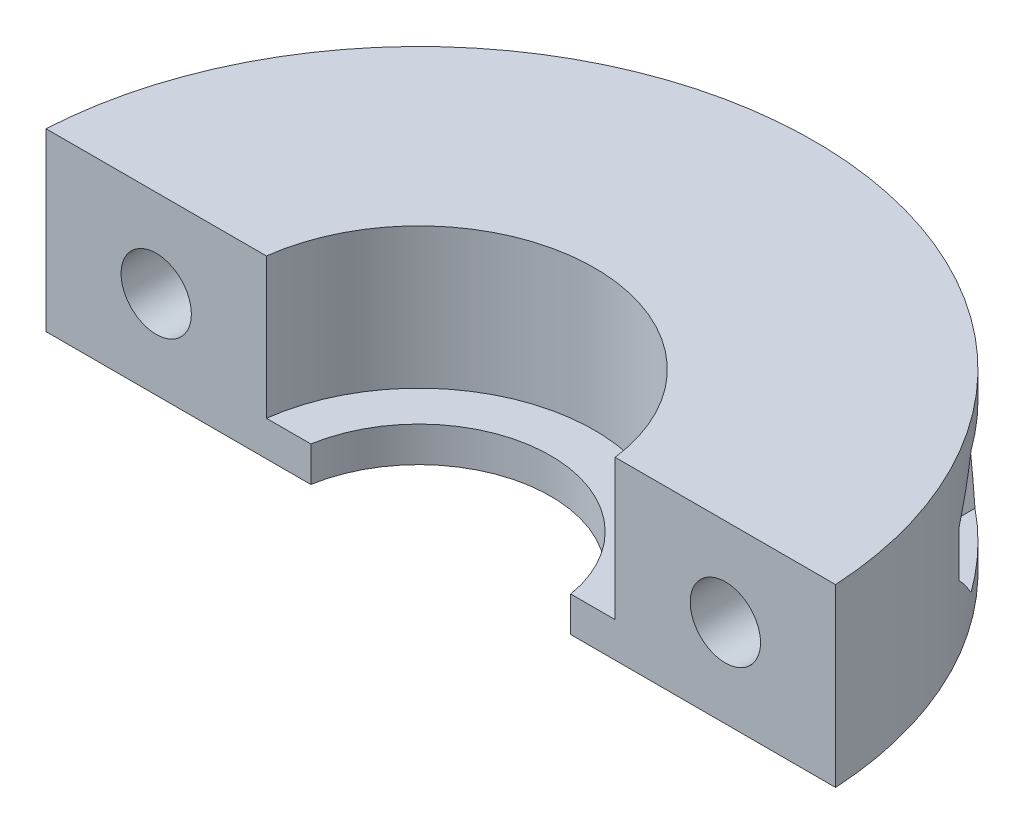
ISO-10303-21;
HEADER;
FILE_DESCRIPTION(('STEP AP214'),'2;1');
FILE_NAME('part.step','',(''),(''),'','','');
FILE_SCHEMA(('AUTOMOTIVE_DESIGN { 1 0 10303 214 1 1 1 1 }'));
ENDSEC;
DATA;
#1=APPLICATION_CONTEXT('core data for automotive mechanical design processes');
#2=APPLICATION_PROTOCOL_DEFINITION('international standard','automotive_design',2000,#1);
#3=PRODUCT_CONTEXT('',#1,'mechanical');
#4=PRODUCT('Part','Part','',(#3));
#5=PRODUCT_RELATED_PRODUCT_CATEGORY('part','',(#4));
#6=PRODUCT_DEFINITION_FORMATION('','',#4);
#7=PRODUCT_DEFINITION_CONTEXT('part definition',#1,'design');
#8=PRODUCT_DEFINITION('design','',#6,#7);
#9=PRODUCT_DEFINITION_SHAPE('','',#8);
#10=(LENGTH_UNIT() NAMED_UNIT(*) SI_UNIT(.MILLI.,.METRE.));
#11=(NAMED_UNIT(*) PLANE_ANGLE_UNIT() SI_UNIT($,.RADIAN.));
#12=(NAMED_UNIT(*) SI_UNIT($,.STERADIAN.) SOLID_ANGLE_UNIT());
#13=UNCERTAINTY_MEASURE_WITH_UNIT(LENGTH_MEASURE(1.E-05),#10,'distance_accuracy_value','');
#14=(GEOMETRIC_REPRESENTATION_CONTEXT(3) GLOBAL_UNCERTAINTY_ASSIGNED_CONTEXT((#13)) GLOBAL_UNIT_ASSIGNED_CONTEXT((#10,
#11,#12)) REPRESENTATION_CONTEXT('',''));
#15=CARTESIAN_POINT('',(0.,0.,0.));
#16=DIRECTION('',(0.,0.,1.));
#17=DIRECTION('',(1.,0.,0.));
#18=AXIS2_PLACEMENT_3D('',#15,#16,#17);
#19=CARTESIAN_POINT('',(0.,8.,0.));
#20=DIRECTION('',(0.,1.,0.));
#21=DIRECTION('',(0.,0.,1.));
#22=AXIS2_PLACEMENT_3D('',#19,#20,#21);
#23=PLANE('',#22);
#24=DIRECTION('',(-1.,0.,0.));
#25=VECTOR('',#24,1.);
#26=CARTESIAN_POINT('',(-20.,8.,-1.));
#27=LINE('',#26,#25);
#28=CARTESIAN_POINT('',(17.9722007556114,8.,-1.));
#29=VERTEX_POINT('',#28);
#30=CARTESIAN_POINT('',(7.93725393319377,8.,-1.));
#31=VERTEX_POINT('',#30);
#32=EDGE_CURVE('E268',#29,#31,#27,.T.);
#33=ORIENTED_EDGE('',*,*,#32,.F.);
#34=CARTESIAN_POINT('',(0.,8.,0.));
#35=DIRECTION('',(0.,1.,0.));
#36=DIRECTION('',(0.,0.,1.));
#37=AXIS2_PLACEMENT_3D('',#34,#35,#36);
#38=CIRCLE('',#37,18.);
#39=CARTESIAN_POINT('',(-17.9722007556114,8.,-1.));
#40=VERTEX_POINT('',#39);
#41=EDGE_CURVE('E293',#29,#40,#38,.T.);
#42=ORIENTED_EDGE('',*,*,#41,.T.);
#43=CARTESIAN_POINT('',(-7.93725393319377,8.,-1.));
#44=VERTEX_POINT('',#43);
#45=EDGE_CURVE('E263',#44,#40,#27,.T.);
#46=ORIENTED_EDGE('',*,*,#45,.F.);
#47=CARTESIAN_POINT('',(0.,8.,0.));
#48=DIRECTION('',(0.,1.,0.));
#49=DIRECTION('',(0.,0.,1.));
#50=AXIS2_PLACEMENT_3D('',#47,#48,#49);
#51=CIRCLE('',#50,8.);
#52=EDGE_CURVE('E287',#31,#44,#51,.T.);
#53=ORIENTED_EDGE('',*,*,#52,.F.);
#54=EDGE_LOOP('',(#33,#42,#46,#53));
#55=FACE_BOUND('',#54,.T.);
#56=ADVANCED_FACE('F32',(#55),#23,.T.);
#57=CARTESIAN_POINT('',(0.,0.,0.));
#58=DIRECTION('',(0.,1.,0.));
#59=DIRECTION('',(0.,0.,1.));
#60=AXIS2_PLACEMENT_3D('',#57,#58,#59);
#61=PLANE('',#60);
#62=CARTESIAN_POINT('',(0.,0.,0.));
#63=DIRECTION('',(0.,1.,0.));
#64=DIRECTION('',(0.,0.,1.));
#65=AXIS2_PLACEMENT_3D('',#62,#63,#64);
#66=CIRCLE('',#65,18.);
#67=CARTESIAN_POINT('',(17.9722007556114,0.,-1.));
#68=VERTEX_POINT('',#67);
#69=CARTESIAN_POINT('',(-17.9722007556114,0.,-1.));
#70=VERTEX_POINT('',#69);
#71=EDGE_CURVE('E292',#68,#70,#66,.T.);
#72=ORIENTED_EDGE('',*,*,#71,.F.);
#73=DIRECTION('',(-1.,0.,0.));
#74=VECTOR('',#73,1.);
#75=CARTESIAN_POINT('',(-20.,0.,-1.));
#76=LINE('',#75,#74);
#77=CARTESIAN_POINT('',(5.91607978309962,0.,-1.));
#78=VERTEX_POINT('',#77);
#79=EDGE_CURVE('E267',#68,#78,#76,.T.);
#80=ORIENTED_EDGE('',*,*,#79,.T.);
#81=CARTESIAN_POINT('',(0.,0.,0.));
#82=DIRECTION('',(0.,1.,0.));
#83=DIRECTION('',(0.,0.,1.));
#84=AXIS2_PLACEMENT_3D('',#81,#82,#83);
#85=CIRCLE('',#84,6.);
#86=CARTESIAN_POINT('',(-5.91607978309962,0.,-1.));
#87=VERTEX_POINT('',#86);
#88=EDGE_CURVE('E283',#78,#87,#85,.T.);
#89=ORIENTED_EDGE('',*,*,#88,.T.);
#90=EDGE_CURVE('E264',#87,#70,#76,.T.);
#91=ORIENTED_EDGE('',*,*,#90,.T.);
#92=EDGE_LOOP('',(#72,#80,#89,#91));
#93=FACE_BOUND('',#92,.T.);
#94=ADVANCED_FACE('F319',(#93),#61,.F.);
#95=CARTESIAN_POINT('',(0.,8.,0.));
#96=DIRECTION('',(0.,-1.,0.));
#97=DIRECTION('',(0.,0.,-1.));
#98=AXIS2_PLACEMENT_3D('',#95,#96,#97);
#99=CYLINDRICAL_SURFACE('',#98,18.);
#100=CARTESIAN_POINT('',(0.,1.19999999999999,0.));
#101=DIRECTION('',(0.,-1.,0.));
#102=DIRECTION('',(1.,0.,0.));
#103=AXIS2_PLACEMENT_3D('',#100,#101,#102);
#104=CIRCLE('',#103,18.);
#105=CARTESIAN_POINT('',(14.5713080981335,1.2,-10.5677329787078));
#106=VERTEX_POINT('',#105);
#107=CARTESIAN_POINT('',(11.3381465906717,1.2,-13.9802157311123));
#108=VERTEX_POINT('',#107);
#109=EDGE_CURVE('E181',#106,#108,#104,.F.);
#110=ORIENTED_EDGE('',*,*,#109,.F.);
#111=CARTESIAN_POINT('',(0.,-24.0382459587072,0.));
#112=DIRECTION('',(0.866025403784439,-0.5,0.));
#113=DIRECTION('',(-0.5,-0.866025403784439,0.));
#114=AXIS2_PLACEMENT_3D('',#111,#112,#113);
#115=ELLIPSE('',#114,36.,18.);
#116=CARTESIAN_POINT('',(15.5884572681199,2.96175404129287,-9.));
#117=VERTEX_POINT('',#116);
#118=EDGE_CURVE('E162',#117,#106,#115,.F.);
#119=ORIENTED_EDGE('',*,*,#118,.F.);
#120=DIRECTION('',(0.,-1.,0.));
#121=VECTOR('',#120,1.);
#122=CARTESIAN_POINT('',(15.5884572681199,8.,-9.));
#123=LINE('',#122,#121);
#124=CARTESIAN_POINT('',(15.5884572681199,5.03824595870713,-9.));
#125=VERTEX_POINT('',#124);
#126=EDGE_CURVE('E171',#125,#117,#123,.T.);
#127=ORIENTED_EDGE('',*,*,#126,.F.);
#128=CARTESIAN_POINT('',(0.,32.0382459587071,0.));
#129=DIRECTION('',(0.866025403784438,0.5,0.));
#130=DIRECTION('',(0.5,-0.866025403784439,0.));
#131=AXIS2_PLACEMENT_3D('',#128,#129,#130);
#132=ELLIPSE('',#131,36.,18.);
#133=CARTESIAN_POINT('',(14.5713080981335,6.8,-10.5677329787078));
#134=VERTEX_POINT('',#133);
#135=EDGE_CURVE('E47',#134,#125,#132,.F.);
#136=ORIENTED_EDGE('',*,*,#135,.F.);
#137=CARTESIAN_POINT('',(0.,6.79999999999999,0.));
#138=DIRECTION('',(0.,1.,0.));
#139=DIRECTION('',(-1.,0.,0.));
#140=AXIS2_PLACEMENT_3D('',#137,#138,#139);
#141=CIRCLE('',#140,18.);
#142=CARTESIAN_POINT('',(11.3381465906717,6.8,-13.9802157311123));
#143=VERTEX_POINT('',#142);
#144=EDGE_CURVE('E557',#143,#134,#141,.F.);
#145=ORIENTED_EDGE('',*,*,#144,.F.);
#146=CARTESIAN_POINT('',(0.,-12.8382459587072,0.));
#147=DIRECTION('',(-0.866025403784439,0.5,0.));
#148=DIRECTION('',(-0.5,-0.866025403784439,0.));
#149=AXIS2_PLACEMENT_3D('',#146,#147,#148);
#150=ELLIPSE('',#149,36.,18.);
#151=CARTESIAN_POINT('',(9.7215658369407,4.,-15.1489655646195));
#152=VERTEX_POINT('',#151);
#153=EDGE_CURVE('E560',#152,#143,#150,.F.);
#154=ORIENTED_EDGE('',*,*,#153,.F.);
#155=CARTESIAN_POINT('',(0.,20.8382459587071,0.));
#156=DIRECTION('',(-0.866025403784438,-0.5,0.));
#157=DIRECTION('',(0.5,-0.866025403784439,0.));
#158=AXIS2_PLACEMENT_3D('',#155,#156,#157);
#159=ELLIPSE('',#158,36.,18.);
#160=EDGE_CURVE('E183',#108,#152,#159,.F.);
#161=ORIENTED_EDGE('',*,*,#160,.F.);
#162=EDGE_LOOP('',(#110,#119,#127,#136,#145,#154,#161));
#163=FACE_BOUND('',#162,.T.);
#164=CARTESIAN_POINT('',(0.,-12.8382459587071,0.));
#165=DIRECTION('',(0.866025403784438,0.5,0.));
#166=DIRECTION('',(0.5,-0.866025403784439,0.));
#167=AXIS2_PLACEMENT_3D('',#164,#165,#166);
#168=ELLIPSE('',#167,36.,18.);
#169=CARTESIAN_POINT('',(-11.3381465906716,6.8,-13.9802157311124));
#170=VERTEX_POINT('',#169);
#171=CARTESIAN_POINT('',(-9.72156583694069,4.,-15.1489655646195));
#172=VERTEX_POINT('',#171);
#173=EDGE_CURVE('E219',#170,#172,#168,.F.);
#174=ORIENTED_EDGE('',*,*,#173,.F.);
#175=CARTESIAN_POINT('',(0.,6.8,0.));
#176=DIRECTION('',(0.,1.,0.));
#177=DIRECTION('',(-1.,0.,0.));
#178=AXIS2_PLACEMENT_3D('',#175,#176,#177);
#179=CIRCLE('',#178,18.);
#180=CARTESIAN_POINT('',(-14.5713080981335,6.8,-10.5677329787078));
#181=VERTEX_POINT('',#180);
#182=EDGE_CURVE('E222',#181,#170,#179,.F.);
#183=ORIENTED_EDGE('',*,*,#182,.F.);
#184=CARTESIAN_POINT('',(0.,32.0382459587072,0.));
#185=DIRECTION('',(-0.866025403784439,0.499999999999999,0.));
#186=DIRECTION('',(-0.499999999999999,-0.866025403784439,0.));
#187=AXIS2_PLACEMENT_3D('',#184,#185,#186);
#188=ELLIPSE('',#187,36.0000000000001,18.);
#189=CARTESIAN_POINT('',(-15.5884572681199,5.03824595870713,-9.));
#190=VERTEX_POINT('',#189);
#191=EDGE_CURVE('E175',#190,#181,#188,.F.);
#192=ORIENTED_EDGE('',*,*,#191,.F.);
#193=DIRECTION('',(0.,-1.,0.));
#194=VECTOR('',#193,1.);
#195=CARTESIAN_POINT('',(-15.5884572681199,8.,-9.));
#196=LINE('',#195,#194);
#197=CARTESIAN_POINT('',(-15.5884572681199,2.96175404129287,-9.));
#198=VERTEX_POINT('',#197);
#199=EDGE_CURVE('E254',#198,#190,#196,.F.);
#200=ORIENTED_EDGE('',*,*,#199,.F.);
#201=CARTESIAN_POINT('',(0.,-24.0382459587071,0.));
#202=DIRECTION('',(-0.866025403784438,-0.5,0.));
#203=DIRECTION('',(0.5,-0.866025403784439,0.));
#204=AXIS2_PLACEMENT_3D('',#201,#202,#203);
#205=ELLIPSE('',#204,36.,18.);
#206=CARTESIAN_POINT('',(-14.5713080981336,1.2,-10.5677329787078));
#207=VERTEX_POINT('',#206);
#208=EDGE_CURVE('E55',#207,#198,#205,.F.);
#209=ORIENTED_EDGE('',*,*,#208,.F.);
#210=CARTESIAN_POINT('',(0.,1.20000000000001,0.));
#211=DIRECTION('',(0.,-1.,0.));
#212=DIRECTION('',(1.,0.,0.));
#213=AXIS2_PLACEMENT_3D('',#210,#211,#212);
#214=CIRCLE('',#213,18.);
#215=CARTESIAN_POINT('',(-11.3381465906716,1.2,-13.9802157311123));
#216=VERTEX_POINT('',#215);
#217=EDGE_CURVE('E213',#216,#207,#214,.F.);
#218=ORIENTED_EDGE('',*,*,#217,.F.);
#219=CARTESIAN_POINT('',(0.,20.8382459587072,0.));
#220=DIRECTION('',(0.866025403784439,-0.5,0.));
#221=DIRECTION('',(-0.5,-0.866025403784439,0.));
#222=AXIS2_PLACEMENT_3D('',#219,#220,#221);
#223=ELLIPSE('',#222,36.,18.);
#224=EDGE_CURVE('E216',#172,#216,#223,.F.);
#225=ORIENTED_EDGE('',*,*,#224,.F.);
#226=EDGE_LOOP('',(#174,#183,#192,#200,#209,#218,#225));
#227=FACE_BOUND('',#226,.T.);
#228=ORIENTED_EDGE('',*,*,#41,.F.);
#229=DIRECTION('',(0.,-1.,0.));
#230=VECTOR('',#229,1.);
#231=CARTESIAN_POINT('',(17.9722007556114,8.,-1.));
#232=LINE('',#231,#230);
#233=EDGE_CURVE('E280',#29,#68,#232,.T.);
#234=ORIENTED_EDGE('',*,*,#233,.T.);
#235=ORIENTED_EDGE('',*,*,#71,.T.);
#236=DIRECTION('',(0.,-1.,0.));
#237=VECTOR('',#236,1.);
#238=CARTESIAN_POINT('',(-17.9722007556114,8.,-1.));
#239=LINE('',#238,#237);
#240=EDGE_CURVE('E277',#70,#40,#239,.F.);
#241=ORIENTED_EDGE('',*,*,#240,.T.);
#242=EDGE_LOOP('',(#228,#234,#235,#241));
#243=FACE_BOUND('',#242,.T.);
#244=ADVANCED_FACE('F34',(#163,#227,#243),#99,.T.);
#245=CARTESIAN_POINT('',(0.,8.,0.));
#246=DIRECTION('',(0.,-1.,0.));
#247=DIRECTION('',(0.,0.,-1.));
#248=AXIS2_PLACEMENT_3D('',#245,#246,#247);
#249=CYLINDRICAL_SURFACE('',#248,8.);
#250=DIRECTION('',(0.,-1.,0.));
#251=VECTOR('',#250,1.);
#252=CARTESIAN_POINT('',(7.93725393319377,8.,-1.));
#253=LINE('',#252,#251);
#254=CARTESIAN_POINT('',(7.93725393319377,1.6,-1.));
#255=VERTEX_POINT('',#254);
#256=EDGE_CURVE('E275',#31,#255,#253,.T.);
#257=ORIENTED_EDGE('',*,*,#256,.F.);
#258=ORIENTED_EDGE('',*,*,#52,.T.);
#259=DIRECTION('',(0.,-1.,0.));
#260=VECTOR('',#259,1.);
#261=CARTESIAN_POINT('',(-7.93725393319377,8.,-1.));
#262=LINE('',#261,#260);
#263=CARTESIAN_POINT('',(-7.93725393319377,1.6,-1.));
#264=VERTEX_POINT('',#263);
#265=EDGE_CURVE('E272',#264,#44,#262,.F.);
#266=ORIENTED_EDGE('',*,*,#265,.F.);
#267=CARTESIAN_POINT('',(0.,1.6,0.));
#268=DIRECTION('',(0.,1.,0.));
#269=DIRECTION('',(0.,0.,1.));
#270=AXIS2_PLACEMENT_3D('',#267,#268,#269);
#271=CIRCLE('',#270,8.);
#272=EDGE_CURVE('E296',#255,#264,#271,.T.);
#273=ORIENTED_EDGE('',*,*,#272,.F.);
#274=EDGE_LOOP('',(#257,#258,#266,#273));
#275=FACE_BOUND('',#274,.T.);
#276=ADVANCED_FACE('F328',(#275),#249,.F.);
#277=CARTESIAN_POINT('',(0.,1.6,0.));
#278=DIRECTION('',(0.,1.,0.));
#279=DIRECTION('',(0.,0.,1.));
#280=AXIS2_PLACEMENT_3D('',#277,#278,#279);
#281=PLANE('',#280);
#282=DIRECTION('',(-1.,0.,0.));
#283=VECTOR('',#282,1.);
#284=CARTESIAN_POINT('',(0.,1.6,-1.));
#285=LINE('',#284,#283);
#286=CARTESIAN_POINT('',(5.91607978309962,1.6,-1.));
#287=VERTEX_POINT('',#286);
#288=EDGE_CURVE('E273',#255,#287,#285,.T.);
#289=ORIENTED_EDGE('',*,*,#288,.F.);
#290=ORIENTED_EDGE('',*,*,#272,.T.);
#291=CARTESIAN_POINT('',(-5.91607978309962,1.6,-1.));
#292=VERTEX_POINT('',#291);
#293=EDGE_CURVE('E270',#292,#264,#285,.T.);
#294=ORIENTED_EDGE('',*,*,#293,.F.);
#295=CARTESIAN_POINT('',(0.,1.6,0.));
#296=DIRECTION('',(0.,1.,0.));
#297=DIRECTION('',(0.,0.,1.));
#298=AXIS2_PLACEMENT_3D('',#295,#296,#297);
#299=CIRCLE('',#298,6.);
#300=EDGE_CURVE('E284',#287,#292,#299,.T.);
#301=ORIENTED_EDGE('',*,*,#300,.F.);
#302=EDGE_LOOP('',(#289,#290,#294,#301));
#303=FACE_BOUND('',#302,.T.);
#304=ADVANCED_FACE('F310',(#303),#281,.T.);
#305=CARTESIAN_POINT('',(0.,1.6,0.));
#306=DIRECTION('',(0.,-1.,0.));
#307=DIRECTION('',(0.,0.,-1.));
#308=AXIS2_PLACEMENT_3D('',#305,#306,#307);
#309=CYLINDRICAL_SURFACE('',#308,6.);
#310=DIRECTION('',(0.,-1.,0.));
#311=VECTOR('',#310,1.);
#312=CARTESIAN_POINT('',(5.91607978309962,1.6,-1.));
#313=LINE('',#312,#311);
#314=EDGE_CURVE('E11',#287,#78,#313,.T.);
#315=ORIENTED_EDGE('',*,*,#314,.F.);
#316=ORIENTED_EDGE('',*,*,#300,.T.);
#317=DIRECTION('',(0.,-1.,0.));
#318=VECTOR('',#317,1.);
#319=CARTESIAN_POINT('',(-5.91607978309962,1.6,-1.));
#320=LINE('',#319,#318);
#321=EDGE_CURVE('E40',#87,#292,#320,.F.);
#322=ORIENTED_EDGE('',*,*,#321,.F.);
#323=ORIENTED_EDGE('',*,*,#88,.F.);
#324=EDGE_LOOP('',(#315,#316,#322,#323));
#325=FACE_BOUND('',#324,.T.);
#326=ADVANCED_FACE('F313',(#325),#309,.F.);
#327=CARTESIAN_POINT('',(-20.,0.,-1.));
#328=DIRECTION('',(0.,0.,-1.));
#329=DIRECTION('',(-1.,0.,0.));
#330=AXIS2_PLACEMENT_3D('',#327,#328,#329);
#331=PLANE('',#330);
#332=CARTESIAN_POINT('',(-12.9547273444026,4.,-1.));
#333=DIRECTION('',(0.,0.,1.));
#334=DIRECTION('',(1.,0.,0.));
#335=AXIS2_PLACEMENT_3D('',#332,#333,#334);
#336=CIRCLE('',#335,1.6);
#337=CARTESIAN_POINT('',(-11.3547273444026,4.,-1.));
#338=VERTEX_POINT('',#337);
#339=EDGE_CURVE('E260',#338,#338,#336,.T.);
#340=ORIENTED_EDGE('',*,*,#339,.F.);
#341=EDGE_LOOP('',(#340));
#342=FACE_BOUND('',#341,.T.);
#343=ORIENTED_EDGE('',*,*,#90,.F.);
#344=ORIENTED_EDGE('',*,*,#321,.T.);
#345=ORIENTED_EDGE('',*,*,#293,.T.);
#346=ORIENTED_EDGE('',*,*,#265,.T.);
#347=ORIENTED_EDGE('',*,*,#45,.T.);
#348=ORIENTED_EDGE('',*,*,#240,.F.);
#349=EDGE_LOOP('',(#343,#344,#345,#346,#347,#348));
#350=FACE_BOUND('',#349,.T.);
#351=ADVANCED_FACE('F303',(#342,#350),#331,.F.);
#352=CARTESIAN_POINT('',(12.9547273444026,4.,-1.));
#353=DIRECTION('',(0.,0.,1.));
#354=DIRECTION('',(1.,0.,0.));
#355=AXIS2_PLACEMENT_3D('',#352,#353,#354);
#356=CIRCLE('',#355,1.6);
#357=CARTESIAN_POINT('',(14.5547273444026,4.,-1.));
#358=VERTEX_POINT('',#357);
#359=EDGE_CURVE('E257',#358,#358,#356,.T.);
#360=ORIENTED_EDGE('',*,*,#359,.F.);
#361=EDGE_LOOP('',(#360));
#362=FACE_BOUND('',#361,.T.);
#363=ORIENTED_EDGE('',*,*,#32,.T.);
#364=ORIENTED_EDGE('',*,*,#256,.T.);
#365=ORIENTED_EDGE('',*,*,#288,.T.);
#366=ORIENTED_EDGE('',*,*,#314,.T.);
#367=ORIENTED_EDGE('',*,*,#79,.F.);
#368=ORIENTED_EDGE('',*,*,#233,.F.);
#369=EDGE_LOOP('',(#363,#364,#365,#366,#367,#368));
#370=FACE_BOUND('',#369,.T.);
#371=ADVANCED_FACE('F316',(#362,#370),#331,.F.);
#372=CARTESIAN_POINT('',(-12.9547273444026,4.,-18.001));
#373=DIRECTION('',(0.,0.,1.));
#374=DIRECTION('',(1.,0.,0.));
#375=AXIS2_PLACEMENT_3D('',#372,#373,#374);
#376=CYLINDRICAL_SURFACE('',#375,1.6);
#377=CARTESIAN_POINT('',(-12.9547273444026,4.,-9.));
#378=DIRECTION('',(0.,0.,1.));
#379=DIRECTION('',(1.,0.,0.));
#380=AXIS2_PLACEMENT_3D('',#377,#378,#379);
#381=CIRCLE('',#380,1.6);
#382=CARTESIAN_POINT('',(-11.3547273444026,4.,-9.));
#383=VERTEX_POINT('',#382);
#384=EDGE_CURVE('E244',#383,#383,#381,.T.);
#385=ORIENTED_EDGE('',*,*,#384,.F.);
#386=EDGE_LOOP('',(#385));
#387=FACE_BOUND('',#386,.T.);
#388=ORIENTED_EDGE('',*,*,#339,.T.);
#389=EDGE_LOOP('',(#388));
#390=FACE_BOUND('',#389,.T.);
#391=ADVANCED_FACE('F359',(#387,#390),#376,.F.);
#392=CARTESIAN_POINT('',(12.9547273444026,4.,-18.001));
#393=DIRECTION('',(0.,0.,1.));
#394=DIRECTION('',(1.,0.,0.));
#395=AXIS2_PLACEMENT_3D('',#392,#393,#394);
#396=CYLINDRICAL_SURFACE('',#395,1.6);
#397=CARTESIAN_POINT('',(12.9547273444026,4.,-9.));
#398=DIRECTION('',(0.,0.,1.));
#399=DIRECTION('',(1.,0.,0.));
#400=AXIS2_PLACEMENT_3D('',#397,#398,#399);
#401=CIRCLE('',#400,1.6);
#402=CARTESIAN_POINT('',(14.5547273444026,4.,-9.));
#403=VERTEX_POINT('',#402);
#404=EDGE_CURVE('E176',#403,#403,#401,.T.);
#405=ORIENTED_EDGE('',*,*,#404,.F.);
#406=EDGE_LOOP('',(#405));
#407=FACE_BOUND('',#406,.T.);
#408=ORIENTED_EDGE('',*,*,#359,.T.);
#409=EDGE_LOOP('',(#408));
#410=FACE_BOUND('',#409,.T.);
#411=ADVANCED_FACE('F364',(#407,#410),#396,.F.);
#412=CARTESIAN_POINT('',(-11.3381465906716,1.2,-18.001));
#413=DIRECTION('',(0.866025403784439,-0.5,0.));
#414=DIRECTION('',(0.5,0.866025403784439,0.));
#415=AXIS2_PLACEMENT_3D('',#412,#413,#414);
#416=PLANE('',#415);
#417=ORIENTED_EDGE('',*,*,#224,.T.);
#418=DIRECTION('',(0.,0.,1.));
#419=VECTOR('',#418,1.);
#420=CARTESIAN_POINT('',(-11.3381465906716,1.2,-18.001));
#421=LINE('',#420,#419);
#422=CARTESIAN_POINT('',(-11.3381465906716,1.2,-9.));
#423=VERTEX_POINT('',#422);
#424=EDGE_CURVE('E242',#216,#423,#421,.T.);
#425=ORIENTED_EDGE('',*,*,#424,.T.);
#426=DIRECTION('',(0.5,0.866025403784439,0.));
#427=VECTOR('',#426,1.);
#428=CARTESIAN_POINT('',(-11.3381465906716,1.2,-9.));
#429=LINE('',#428,#427);
#430=CARTESIAN_POINT('',(-9.72156583694069,4.,-9.));
#431=VERTEX_POINT('',#430);
#432=EDGE_CURVE('E225',#423,#431,#429,.T.);
#433=ORIENTED_EDGE('',*,*,#432,.T.);
#434=DIRECTION('',(0.,0.,1.));
#435=VECTOR('',#434,1.);
#436=CARTESIAN_POINT('',(-9.72156583694069,4.,-18.001));
#437=LINE('',#436,#435);
#438=EDGE_CURVE('E241',#172,#431,#437,.T.);
#439=ORIENTED_EDGE('',*,*,#438,.F.);
#440=EDGE_LOOP('',(#417,#425,#433,#439));
#441=FACE_BOUND('',#440,.T.);
#442=ADVANCED_FACE('F374',(#441),#416,.F.);
#443=CARTESIAN_POINT('',(-14.5713080981336,1.2,-18.001));
#444=DIRECTION('',(0.,-1.,0.));
#445=DIRECTION('',(1.,0.,0.));
#446=AXIS2_PLACEMENT_3D('',#443,#444,#445);
#447=PLANE('',#446);
#448=ORIENTED_EDGE('',*,*,#217,.T.);
#449=DIRECTION('',(0.,0.,1.));
#450=VECTOR('',#449,1.);
#451=CARTESIAN_POINT('',(-14.5713080981336,1.2,-18.001));
#452=LINE('',#451,#450);
#453=CARTESIAN_POINT('',(-14.5713080981336,1.2,-9.));
#454=VERTEX_POINT('',#453);
#455=EDGE_CURVE('E245',#207,#454,#452,.T.);
#456=ORIENTED_EDGE('',*,*,#455,.T.);
#457=DIRECTION('',(1.,0.,0.));
#458=VECTOR('',#457,1.);
#459=CARTESIAN_POINT('',(-14.5713080981336,1.2,-9.));
#460=LINE('',#459,#458);
#461=EDGE_CURVE('E238',#454,#423,#460,.T.);
#462=ORIENTED_EDGE('',*,*,#461,.T.);
#463=ORIENTED_EDGE('',*,*,#424,.F.);
#464=EDGE_LOOP('',(#448,#456,#462,#463));
#465=FACE_BOUND('',#464,.T.);
#466=ADVANCED_FACE('F384',(#465),#447,.F.);
#467=CARTESIAN_POINT('',(-16.1878888518645,3.99999999999999,-18.001));
#468=DIRECTION('',(-0.866025403784438,-0.5,0.));
#469=DIRECTION('',(0.5,-0.866025403784439,0.));
#470=AXIS2_PLACEMENT_3D('',#467,#468,#469);
#471=PLANE('',#470);
#472=ORIENTED_EDGE('',*,*,#208,.T.);
#473=DIRECTION('',(0.5,-0.866025403784439,0.));
#474=VECTOR('',#473,1.);
#475=CARTESIAN_POINT('',(-16.1878888518645,3.99999999999999,-9.));
#476=LINE('',#475,#474);
#477=EDGE_CURVE('E236',#198,#454,#476,.T.);
#478=ORIENTED_EDGE('',*,*,#477,.T.);
#479=ORIENTED_EDGE('',*,*,#455,.F.);
#480=EDGE_LOOP('',(#472,#478,#479));
#481=FACE_BOUND('',#480,.T.);
#482=ADVANCED_FACE('F394',(#481),#471,.F.);
#483=CARTESIAN_POINT('',(-14.5713080981335,6.8,-18.001));
#484=DIRECTION('',(-0.866025403784439,0.499999999999999,0.));
#485=DIRECTION('',(-0.499999999999999,-0.866025403784439,0.));
#486=AXIS2_PLACEMENT_3D('',#483,#484,#485);
#487=PLANE('',#486);
#488=ORIENTED_EDGE('',*,*,#191,.T.);
#489=DIRECTION('',(0.,0.,1.));
#490=VECTOR('',#489,1.);
#491=CARTESIAN_POINT('',(-14.5713080981335,6.8,-18.001));
#492=LINE('',#491,#490);
#493=CARTESIAN_POINT('',(-14.5713080981335,6.8,-9.));
#494=VERTEX_POINT('',#493);
#495=EDGE_CURVE('E247',#181,#494,#492,.T.);
#496=ORIENTED_EDGE('',*,*,#495,.T.);
#497=DIRECTION('',(-0.499999999999999,-0.866025403784439,0.));
#498=VECTOR('',#497,1.);
#499=CARTESIAN_POINT('',(-14.5713080981335,6.8,-9.));
#500=LINE('',#499,#498);
#501=EDGE_CURVE('E234',#494,#190,#500,.T.);
#502=ORIENTED_EDGE('',*,*,#501,.T.);
#503=EDGE_LOOP('',(#488,#496,#502));
#504=FACE_BOUND('',#503,.T.);
#505=ADVANCED_FACE('F404',(#504),#487,.F.);
#506=CARTESIAN_POINT('',(-11.3381465906716,6.8,-18.001));
#507=DIRECTION('',(0.,1.,0.));
#508=DIRECTION('',(-1.,0.,0.));
#509=AXIS2_PLACEMENT_3D('',#506,#507,#508);
#510=PLANE('',#509);
#511=ORIENTED_EDGE('',*,*,#182,.T.);
#512=DIRECTION('',(0.,0.,1.));
#513=VECTOR('',#512,1.);
#514=CARTESIAN_POINT('',(-11.3381465906716,6.8,-18.001));
#515=LINE('',#514,#513);
#516=CARTESIAN_POINT('',(-11.3381465906716,6.8,-9.));
#517=VERTEX_POINT('',#516);
#518=EDGE_CURVE('E249',#170,#517,#515,.T.);
#519=ORIENTED_EDGE('',*,*,#518,.T.);
#520=DIRECTION('',(-1.,0.,0.));
#521=VECTOR('',#520,1.);
#522=CARTESIAN_POINT('',(-11.3381465906716,6.8,-9.));
#523=LINE('',#522,#521);
#524=EDGE_CURVE('E231',#517,#494,#523,.T.);
#525=ORIENTED_EDGE('',*,*,#524,.T.);
#526=ORIENTED_EDGE('',*,*,#495,.F.);
#527=EDGE_LOOP('',(#511,#519,#525,#526));
#528=FACE_BOUND('',#527,.T.);
#529=ADVANCED_FACE('F413',(#528),#510,.F.);
#530=CARTESIAN_POINT('',(-9.72156583694069,4.,-18.001));
#531=DIRECTION('',(0.866025403784438,0.5,0.));
#532=DIRECTION('',(-0.5,0.866025403784439,0.));
#533=AXIS2_PLACEMENT_3D('',#530,#531,#532);
#534=PLANE('',#533);
#535=ORIENTED_EDGE('',*,*,#173,.T.);
#536=ORIENTED_EDGE('',*,*,#438,.T.);
#537=DIRECTION('',(-0.5,0.866025403784438,0.));
#538=VECTOR('',#537,1.);
#539=CARTESIAN_POINT('',(-9.72156583694069,4.,-9.));
#540=LINE('',#539,#538);
#541=EDGE_CURVE('E228',#431,#517,#540,.T.);
#542=ORIENTED_EDGE('',*,*,#541,.T.);
#543=ORIENTED_EDGE('',*,*,#518,.F.);
#544=EDGE_LOOP('',(#535,#536,#542,#543));
#545=FACE_BOUND('',#544,.T.);
#546=ADVANCED_FACE('F423',(#545),#534,.F.);
#547=CARTESIAN_POINT('',(0.,0.,-9.));
#548=DIRECTION('',(0.,0.,1.));
#549=DIRECTION('',(1.,0.,0.));
#550=AXIS2_PLACEMENT_3D('',#547,#548,#549);
#551=PLANE('',#550);
#552=ORIENTED_EDGE('',*,*,#384,.T.);
#553=EDGE_LOOP('',(#552));
#554=FACE_BOUND('',#553,.T.);
#555=ORIENTED_EDGE('',*,*,#199,.T.);
#556=ORIENTED_EDGE('',*,*,#501,.F.);
#557=ORIENTED_EDGE('',*,*,#524,.F.);
#558=ORIENTED_EDGE('',*,*,#541,.F.);
#559=ORIENTED_EDGE('',*,*,#432,.F.);
#560=ORIENTED_EDGE('',*,*,#461,.F.);
#561=ORIENTED_EDGE('',*,*,#477,.F.);
#562=EDGE_LOOP('',(#555,#556,#557,#558,#559,#560,#561));
#563=FACE_BOUND('',#562,.T.);
#564=ADVANCED_FACE('F433',(#554,#563),#551,.F.);
#565=CARTESIAN_POINT('',(14.5713080981335,1.2,-18.001));
#566=DIRECTION('',(0.866025403784439,-0.5,0.));
#567=DIRECTION('',(0.5,0.866025403784439,0.));
#568=AXIS2_PLACEMENT_3D('',#565,#566,#567);
#569=PLANE('',#568);
#570=ORIENTED_EDGE('',*,*,#118,.T.);
#571=DIRECTION('',(0.,0.,1.));
#572=VECTOR('',#571,1.);
#573=CARTESIAN_POINT('',(14.5713080981335,1.2,-18.001));
#574=LINE('',#573,#572);
#575=CARTESIAN_POINT('',(14.5713080981335,1.2,-9.));
#576=VERTEX_POINT('',#575);
#577=EDGE_CURVE('E164',#106,#576,#574,.T.);
#578=ORIENTED_EDGE('',*,*,#577,.T.);
#579=DIRECTION('',(0.5,0.866025403784439,0.));
#580=VECTOR('',#579,1.);
#581=CARTESIAN_POINT('',(14.5713080981335,1.2,-9.));
#582=LINE('',#581,#580);
#583=EDGE_CURVE('E158',#576,#117,#582,.T.);
#584=ORIENTED_EDGE('',*,*,#583,.T.);
#585=EDGE_LOOP('',(#570,#578,#584));
#586=FACE_BOUND('',#585,.T.);
#587=ADVANCED_FACE('F160',(#586),#569,.F.);
#588=CARTESIAN_POINT('',(11.3381465906717,1.2,-18.001));
#589=DIRECTION('',(0.,-1.,0.));
#590=DIRECTION('',(1.,0.,0.));
#591=AXIS2_PLACEMENT_3D('',#588,#589,#590);
#592=PLANE('',#591);
#593=ORIENTED_EDGE('',*,*,#109,.T.);
#594=DIRECTION('',(0.,0.,1.));
#595=VECTOR('',#594,1.);
#596=CARTESIAN_POINT('',(11.3381465906717,1.2,-18.001));
#597=LINE('',#596,#595);
#598=CARTESIAN_POINT('',(11.3381465906717,1.2,-9.));
#599=VERTEX_POINT('',#598);
#600=EDGE_CURVE('E201',#108,#599,#597,.T.);
#601=ORIENTED_EDGE('',*,*,#600,.T.);
#602=DIRECTION('',(1.,0.,0.));
#603=VECTOR('',#602,1.);
#604=CARTESIAN_POINT('',(11.3381465906717,1.2,-9.));
#605=LINE('',#604,#603);
#606=EDGE_CURVE('E197',#599,#576,#605,.T.);
#607=ORIENTED_EDGE('',*,*,#606,.T.);
#608=ORIENTED_EDGE('',*,*,#577,.F.);
#609=EDGE_LOOP('',(#593,#601,#607,#608));
#610=FACE_BOUND('',#609,.T.);
#611=ADVANCED_FACE('F452',(#610),#592,.F.);
#612=CARTESIAN_POINT('',(9.7215658369407,4.,-18.001));
#613=DIRECTION('',(-0.866025403784438,-0.5,0.));
#614=DIRECTION('',(0.5,-0.866025403784439,0.));
#615=AXIS2_PLACEMENT_3D('',#612,#613,#614);
#616=PLANE('',#615);
#617=ORIENTED_EDGE('',*,*,#160,.T.);
#618=DIRECTION('',(0.,0.,1.));
#619=VECTOR('',#618,1.);
#620=CARTESIAN_POINT('',(9.7215658369407,4.,-18.001));
#621=LINE('',#620,#619);
#622=CARTESIAN_POINT('',(9.7215658369407,4.,-9.));
#623=VERTEX_POINT('',#622);
#624=EDGE_CURVE('E203',#152,#623,#621,.T.);
#625=ORIENTED_EDGE('',*,*,#624,.T.);
#626=DIRECTION('',(0.5,-0.866025403784438,0.));
#627=VECTOR('',#626,1.);
#628=CARTESIAN_POINT('',(9.7215658369407,4.,-9.));
#629=LINE('',#628,#627);
#630=EDGE_CURVE('E194',#623,#599,#629,.T.);
#631=ORIENTED_EDGE('',*,*,#630,.T.);
#632=ORIENTED_EDGE('',*,*,#600,.F.);
#633=EDGE_LOOP('',(#617,#625,#631,#632));
#634=FACE_BOUND('',#633,.T.);
#635=ADVANCED_FACE('F461',(#634),#616,.F.);
#636=CARTESIAN_POINT('',(11.3381465906717,6.8,-18.001));
#637=DIRECTION('',(-0.866025403784439,0.5,0.));
#638=DIRECTION('',(-0.5,-0.866025403784439,0.));
#639=AXIS2_PLACEMENT_3D('',#636,#637,#638);
#640=PLANE('',#639);
#641=ORIENTED_EDGE('',*,*,#153,.T.);
#642=DIRECTION('',(0.,0.,1.));
#643=VECTOR('',#642,1.);
#644=CARTESIAN_POINT('',(11.3381465906717,6.8,-18.001));
#645=LINE('',#644,#643);
#646=CARTESIAN_POINT('',(11.3381465906717,6.8,-9.));
#647=VERTEX_POINT('',#646);
#648=EDGE_CURVE('E205',#143,#647,#645,.T.);
#649=ORIENTED_EDGE('',*,*,#648,.T.);
#650=DIRECTION('',(-0.5,-0.866025403784439,0.));
#651=VECTOR('',#650,1.);
#652=CARTESIAN_POINT('',(11.3381465906717,6.8,-9.));
#653=LINE('',#652,#651);
#654=EDGE_CURVE('E191',#647,#623,#653,.T.);
#655=ORIENTED_EDGE('',*,*,#654,.T.);
#656=ORIENTED_EDGE('',*,*,#624,.F.);
#657=EDGE_LOOP('',(#641,#649,#655,#656));
#658=FACE_BOUND('',#657,.T.);
#659=ADVANCED_FACE('F471',(#658),#640,.F.);
#660=CARTESIAN_POINT('',(14.5713080981335,6.8,-18.001));
#661=DIRECTION('',(0.,1.,0.));
#662=DIRECTION('',(-1.,0.,0.));
#663=AXIS2_PLACEMENT_3D('',#660,#661,#662);
#664=PLANE('',#663);
#665=ORIENTED_EDGE('',*,*,#144,.T.);
#666=DIRECTION('',(0.,0.,1.));
#667=VECTOR('',#666,1.);
#668=CARTESIAN_POINT('',(14.5713080981335,6.8,-18.001));
#669=LINE('',#668,#667);
#670=CARTESIAN_POINT('',(14.5713080981335,6.8,-9.));
#671=VERTEX_POINT('',#670);
#672=EDGE_CURVE('E199',#134,#671,#669,.T.);
#673=ORIENTED_EDGE('',*,*,#672,.T.);
#674=DIRECTION('',(-1.,0.,0.));
#675=VECTOR('',#674,1.);
#676=CARTESIAN_POINT('',(14.5713080981335,6.8,-9.));
#677=LINE('',#676,#675);
#678=EDGE_CURVE('E188',#671,#647,#677,.T.);
#679=ORIENTED_EDGE('',*,*,#678,.T.);
#680=ORIENTED_EDGE('',*,*,#648,.F.);
#681=EDGE_LOOP('',(#665,#673,#679,#680));
#682=FACE_BOUND('',#681,.T.);
#683=ADVANCED_FACE('F481',(#682),#664,.F.);
#684=CARTESIAN_POINT('',(16.1878888518645,4.,-18.001));
#685=DIRECTION('',(0.866025403784438,0.5,0.));
#686=DIRECTION('',(-0.5,0.866025403784439,0.));
#687=AXIS2_PLACEMENT_3D('',#684,#685,#686);
#688=PLANE('',#687);
#689=ORIENTED_EDGE('',*,*,#135,.T.);
#690=DIRECTION('',(-0.5,0.866025403784439,0.));
#691=VECTOR('',#690,1.);
#692=CARTESIAN_POINT('',(16.1878888518645,4.,-9.));
#693=LINE('',#692,#691);
#694=EDGE_CURVE('E168',#125,#671,#693,.T.);
#695=ORIENTED_EDGE('',*,*,#694,.T.);
#696=ORIENTED_EDGE('',*,*,#672,.F.);
#697=EDGE_LOOP('',(#689,#695,#696));
#698=FACE_BOUND('',#697,.T.);
#699=ADVANCED_FACE('F491',(#698),#688,.F.);
#700=CARTESIAN_POINT('',(0.,0.,-9.));
#701=DIRECTION('',(0.,0.,1.));
#702=DIRECTION('',(1.,0.,0.));
#703=AXIS2_PLACEMENT_3D('',#700,#701,#702);
#704=PLANE('',#703);
#705=ORIENTED_EDGE('',*,*,#404,.T.);
#706=EDGE_LOOP('',(#705));
#707=FACE_BOUND('',#706,.T.);
#708=ORIENTED_EDGE('',*,*,#126,.T.);
#709=ORIENTED_EDGE('',*,*,#583,.F.);
#710=ORIENTED_EDGE('',*,*,#606,.F.);
#711=ORIENTED_EDGE('',*,*,#630,.F.);
#712=ORIENTED_EDGE('',*,*,#654,.F.);
#713=ORIENTED_EDGE('',*,*,#678,.F.);
#714=ORIENTED_EDGE('',*,*,#694,.F.);
#715=EDGE_LOOP('',(#708,#709,#710,#711,#712,#713,#714));
#716=FACE_BOUND('',#715,.T.);
#717=ADVANCED_FACE('F172',(#707,#716),#704,.F.);
#718=CLOSED_SHELL('',(#56,#94,#244,#276,#304,#326,#351,#371,#391,#411,#442,#466,#482,#505,#529,
#546,#564,#587,#611,#635,#659,#683,#699,#717));
#719=MANIFOLD_SOLID_BREP('B2',#718);
#720=ADVANCED_BREP_SHAPE_REPRESENTATION('',(#18,#719),#14);
#721=SHAPE_DEFINITION_REPRESENTATION(#9,#720);
ENDSEC;
END-ISO-10303-21;
